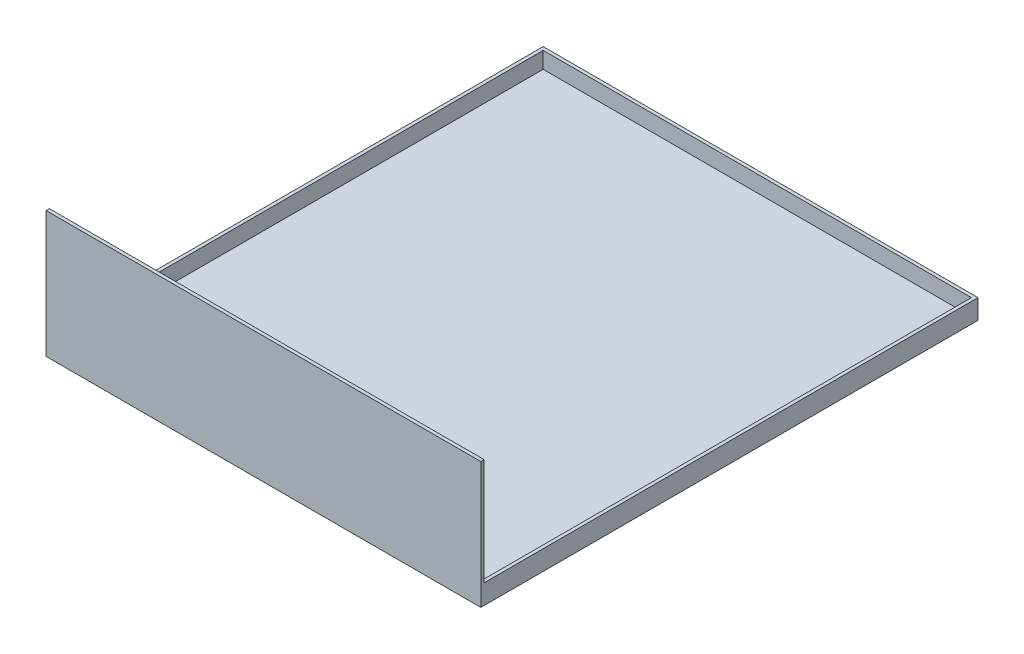
ISO-10303-21;
HEADER;
FILE_DESCRIPTION(('STEP AP214'),'2;1');
FILE_NAME('part.step','',(''),(''),'','','');
FILE_SCHEMA(('AUTOMOTIVE_DESIGN { 1 0 10303 214 1 1 1 1 }'));
ENDSEC;
DATA;
#1=APPLICATION_CONTEXT('core data for automotive mechanical design processes');
#2=APPLICATION_PROTOCOL_DEFINITION('international standard','automotive_design',2000,#1);
#3=PRODUCT_CONTEXT('',#1,'mechanical');
#4=PRODUCT('Part','Part','',(#3));
#5=PRODUCT_RELATED_PRODUCT_CATEGORY('part','',(#4));
#6=PRODUCT_DEFINITION_FORMATION('','',#4);
#7=PRODUCT_DEFINITION_CONTEXT('part definition',#1,'design');
#8=PRODUCT_DEFINITION('design','',#6,#7);
#9=PRODUCT_DEFINITION_SHAPE('','',#8);
#10=(LENGTH_UNIT() NAMED_UNIT(*) SI_UNIT(.MILLI.,.METRE.));
#11=(NAMED_UNIT(*) PLANE_ANGLE_UNIT() SI_UNIT($,.RADIAN.));
#12=(NAMED_UNIT(*) SI_UNIT($,.STERADIAN.) SOLID_ANGLE_UNIT());
#13=UNCERTAINTY_MEASURE_WITH_UNIT(LENGTH_MEASURE(1.E-05),#10,'distance_accuracy_value','');
#14=(GEOMETRIC_REPRESENTATION_CONTEXT(3) GLOBAL_UNCERTAINTY_ASSIGNED_CONTEXT((#13)) GLOBAL_UNIT_ASSIGNED_CONTEXT((#10,
#11,#12)) REPRESENTATION_CONTEXT('',''));
#15=CARTESIAN_POINT('',(0.,0.,0.));
#16=DIRECTION('',(0.,0.,1.));
#17=DIRECTION('',(1.,0.,0.));
#18=AXIS2_PLACEMENT_3D('',#15,#16,#17);
#19=CARTESIAN_POINT('',(0.,0.,0.));
#20=DIRECTION('',(0.,0.,1.));
#21=DIRECTION('',(1.,0.,0.));
#22=AXIS2_PLACEMENT_3D('',#19,#20,#21);
#23=PLANE('',#22);
#24=DIRECTION('',(-1.,0.,0.));
#25=VECTOR('',#24,1.);
#26=CARTESIAN_POINT('',(-132.5,-19.,0.));
#27=LINE('',#26,#25);
#28=CARTESIAN_POINT('',(132.5,-19.,0.));
#29=VERTEX_POINT('',#28);
#30=CARTESIAN_POINT('',(-132.5,-19.,0.));
#31=VERTEX_POINT('',#30);
#32=EDGE_CURVE('E89',#29,#31,#27,.T.);
#33=ORIENTED_EDGE('',*,*,#32,.F.);
#34=DIRECTION('',(0.,1.,0.));
#35=VECTOR('',#34,1.);
#36=CARTESIAN_POINT('',(132.5,31.,0.));
#37=LINE('',#36,#35);
#38=CARTESIAN_POINT('',(132.5,-31.,0.));
#39=VERTEX_POINT('',#38);
#40=EDGE_CURVE('E84',#39,#29,#37,.T.);
#41=ORIENTED_EDGE('',*,*,#40,.F.);
#42=DIRECTION('',(1.,0.,0.));
#43=VECTOR('',#42,1.);
#44=CARTESIAN_POINT('',(-132.5,-31.,0.));
#45=LINE('',#44,#43);
#46=CARTESIAN_POINT('',(-132.5,-31.,0.));
#47=VERTEX_POINT('',#46);
#48=EDGE_CURVE('E68',#47,#39,#45,.T.);
#49=ORIENTED_EDGE('',*,*,#48,.F.);
#50=DIRECTION('',(0.,-1.,0.));
#51=VECTOR('',#50,1.);
#52=CARTESIAN_POINT('',(-132.5,31.,0.));
#53=LINE('',#52,#51);
#54=EDGE_CURVE('E78',#31,#47,#53,.T.);
#55=ORIENTED_EDGE('',*,*,#54,.F.);
#56=EDGE_LOOP('',(#33,#41,#49,#55));
#57=FACE_BOUND('',#56,.T.);
#58=ADVANCED_FACE('F32',(#57),#23,.F.);
#59=CARTESIAN_POINT('',(130.5,31.,303.));
#60=DIRECTION('',(-1.,0.,0.));
#61=DIRECTION('',(0.,0.,1.));
#62=AXIS2_PLACEMENT_3D('',#59,#60,#61);
#63=PLANE('',#62);
#64=DIRECTION('',(0.,1.,0.));
#65=VECTOR('',#64,1.);
#66=CARTESIAN_POINT('',(130.5,31.,301.));
#67=LINE('',#66,#65);
#68=CARTESIAN_POINT('',(130.5,-29.,301.));
#69=VERTEX_POINT('',#68);
#70=CARTESIAN_POINT('',(130.5,-19.,301.));
#71=VERTEX_POINT('',#70);
#72=EDGE_CURVE('E105',#69,#71,#67,.T.);
#73=ORIENTED_EDGE('',*,*,#72,.T.);
#74=DIRECTION('',(0.,0.,-1.));
#75=VECTOR('',#74,1.);
#76=CARTESIAN_POINT('',(130.5,-19.,303.));
#77=LINE('',#76,#75);
#78=CARTESIAN_POINT('',(130.5,-19.,2.));
#79=VERTEX_POINT('',#78);
#80=EDGE_CURVE('E121',#71,#79,#77,.T.);
#81=ORIENTED_EDGE('',*,*,#80,.T.);
#82=DIRECTION('',(0.,1.,0.));
#83=VECTOR('',#82,1.);
#84=CARTESIAN_POINT('',(130.5,31.,2.));
#85=LINE('',#84,#83);
#86=CARTESIAN_POINT('',(130.5,-29.,2.));
#87=VERTEX_POINT('',#86);
#88=EDGE_CURVE('E109',#87,#79,#85,.T.);
#89=ORIENTED_EDGE('',*,*,#88,.F.);
#90=DIRECTION('',(0.,0.,-1.));
#91=VECTOR('',#90,1.);
#92=CARTESIAN_POINT('',(130.5,-29.,303.));
#93=LINE('',#92,#91);
#94=EDGE_CURVE('E94',#69,#87,#93,.T.);
#95=ORIENTED_EDGE('',*,*,#94,.F.);
#96=EDGE_LOOP('',(#73,#81,#89,#95));
#97=FACE_BOUND('',#96,.T.);
#98=ADVANCED_FACE('F208',(#97),#63,.T.);
#99=CARTESIAN_POINT('',(-130.5,31.,303.));
#100=DIRECTION('',(1.,0.,0.));
#101=DIRECTION('',(0.,0.,-1.));
#102=AXIS2_PLACEMENT_3D('',#99,#100,#101);
#103=PLANE('',#102);
#104=DIRECTION('',(0.,-1.,0.));
#105=VECTOR('',#104,1.);
#106=CARTESIAN_POINT('',(-130.5,31.,2.));
#107=LINE('',#106,#105);
#108=CARTESIAN_POINT('',(-130.5,-19.,2.));
#109=VERTEX_POINT('',#108);
#110=CARTESIAN_POINT('',(-130.5,-29.,2.));
#111=VERTEX_POINT('',#110);
#112=EDGE_CURVE('E106',#109,#111,#107,.T.);
#113=ORIENTED_EDGE('',*,*,#112,.F.);
#114=DIRECTION('',(0.,0.,1.));
#115=VECTOR('',#114,1.);
#116=CARTESIAN_POINT('',(-130.5,-19.,303.));
#117=LINE('',#116,#115);
#118=CARTESIAN_POINT('',(-130.5,-19.,301.));
#119=VERTEX_POINT('',#118);
#120=EDGE_CURVE('E47',#109,#119,#117,.T.);
#121=ORIENTED_EDGE('',*,*,#120,.T.);
#122=DIRECTION('',(0.,-1.,0.));
#123=VECTOR('',#122,1.);
#124=CARTESIAN_POINT('',(-130.5,31.,301.));
#125=LINE('',#124,#123);
#126=CARTESIAN_POINT('',(-130.5,-29.,301.));
#127=VERTEX_POINT('',#126);
#128=EDGE_CURVE('E101',#119,#127,#125,.T.);
#129=ORIENTED_EDGE('',*,*,#128,.T.);
#130=DIRECTION('',(0.,0.,-1.));
#131=VECTOR('',#130,1.);
#132=CARTESIAN_POINT('',(-130.5,-29.,303.));
#133=LINE('',#132,#131);
#134=EDGE_CURVE('E90',#127,#111,#133,.T.);
#135=ORIENTED_EDGE('',*,*,#134,.T.);
#136=EDGE_LOOP('',(#113,#121,#129,#135));
#137=FACE_BOUND('',#136,.T.);
#138=ADVANCED_FACE('F197',(#137),#103,.T.);
#139=CARTESIAN_POINT('',(0.,0.,2.));
#140=DIRECTION('',(0.,0.,1.));
#141=DIRECTION('',(1.,0.,0.));
#142=AXIS2_PLACEMENT_3D('',#139,#140,#141);
#143=PLANE('',#142);
#144=ORIENTED_EDGE('',*,*,#88,.T.);
#145=DIRECTION('',(-1.,0.,0.));
#146=VECTOR('',#145,1.);
#147=CARTESIAN_POINT('',(0.,-19.,2.));
#148=LINE('',#147,#146);
#149=EDGE_CURVE('E11',#79,#109,#148,.T.);
#150=ORIENTED_EDGE('',*,*,#149,.T.);
#151=ORIENTED_EDGE('',*,*,#112,.T.);
#152=DIRECTION('',(1.,0.,0.));
#153=VECTOR('',#152,1.);
#154=CARTESIAN_POINT('',(-132.5,-29.,2.));
#155=LINE('',#154,#153);
#156=EDGE_CURVE('E108',#111,#87,#155,.T.);
#157=ORIENTED_EDGE('',*,*,#156,.T.);
#158=EDGE_LOOP('',(#144,#150,#151,#157));
#159=FACE_BOUND('',#158,.T.);
#160=ADVANCED_FACE('F211',(#159),#143,.T.);
#161=CARTESIAN_POINT('',(132.5,31.,303.));
#162=DIRECTION('',(-1.,0.,0.));
#163=DIRECTION('',(0.,0.,1.));
#164=AXIS2_PLACEMENT_3D('',#161,#162,#163);
#165=PLANE('',#164);
#166=DIRECTION('',(0.,0.,-1.));
#167=VECTOR('',#166,1.);
#168=CARTESIAN_POINT('',(132.5,-19.,0.));
#169=LINE('',#168,#167);
#170=CARTESIAN_POINT('',(132.5,-19.,301.));
#171=VERTEX_POINT('',#170);
#172=EDGE_CURVE('E132',#171,#29,#169,.T.);
#173=ORIENTED_EDGE('',*,*,#172,.F.);
#174=DIRECTION('',(0.,1.,0.));
#175=VECTOR('',#174,1.);
#176=CARTESIAN_POINT('',(132.5,-19.,301.));
#177=LINE('',#176,#175);
#178=CARTESIAN_POINT('',(132.5,46.,301.));
#179=VERTEX_POINT('',#178);
#180=EDGE_CURVE('E125',#171,#179,#177,.T.);
#181=ORIENTED_EDGE('',*,*,#180,.T.);
#182=DIRECTION('',(0.,0.,-1.));
#183=VECTOR('',#182,1.);
#184=CARTESIAN_POINT('',(132.5,46.,301.));
#185=LINE('',#184,#183);
#186=CARTESIAN_POINT('',(132.5,46.,303.));
#187=VERTEX_POINT('',#186);
#188=EDGE_CURVE('E144',#187,#179,#185,.T.);
#189=ORIENTED_EDGE('',*,*,#188,.F.);
#190=DIRECTION('',(0.,1.,0.));
#191=VECTOR('',#190,1.);
#192=CARTESIAN_POINT('',(132.5,31.,303.));
#193=LINE('',#192,#191);
#194=CARTESIAN_POINT('',(132.5,-31.,303.));
#195=VERTEX_POINT('',#194);
#196=EDGE_CURVE('E77',#195,#187,#193,.T.);
#197=ORIENTED_EDGE('',*,*,#196,.F.);
#198=DIRECTION('',(0.,0.,-1.));
#199=VECTOR('',#198,1.);
#200=CARTESIAN_POINT('',(132.5,-31.,303.));
#201=LINE('',#200,#199);
#202=EDGE_CURVE('E71',#195,#39,#201,.T.);
#203=ORIENTED_EDGE('',*,*,#202,.T.);
#204=ORIENTED_EDGE('',*,*,#40,.T.);
#205=EDGE_LOOP('',(#173,#181,#189,#197,#203,#204));
#206=FACE_BOUND('',#205,.T.);
#207=ADVANCED_FACE('F34',(#206),#165,.F.);
#208=CARTESIAN_POINT('',(-132.5,31.,303.));
#209=DIRECTION('',(1.,0.,0.));
#210=DIRECTION('',(0.,0.,-1.));
#211=AXIS2_PLACEMENT_3D('',#208,#209,#210);
#212=PLANE('',#211);
#213=DIRECTION('',(0.,-1.,0.));
#214=VECTOR('',#213,1.);
#215=CARTESIAN_POINT('',(-132.5,31.,303.));
#216=LINE('',#215,#214);
#217=CARTESIAN_POINT('',(-132.5,46.,303.));
#218=VERTEX_POINT('',#217);
#219=CARTESIAN_POINT('',(-132.5,-31.,303.));
#220=VERTEX_POINT('',#219);
#221=EDGE_CURVE('E98',#218,#220,#216,.T.);
#222=ORIENTED_EDGE('',*,*,#221,.F.);
#223=DIRECTION('',(0.,0.,1.));
#224=VECTOR('',#223,1.);
#225=CARTESIAN_POINT('',(-132.5,46.,301.));
#226=LINE('',#225,#224);
#227=CARTESIAN_POINT('',(-132.5,46.,301.));
#228=VERTEX_POINT('',#227);
#229=EDGE_CURVE('E150',#228,#218,#226,.T.);
#230=ORIENTED_EDGE('',*,*,#229,.F.);
#231=DIRECTION('',(0.,1.,0.));
#232=VECTOR('',#231,1.);
#233=CARTESIAN_POINT('',(-132.5,-19.,301.));
#234=LINE('',#233,#232);
#235=CARTESIAN_POINT('',(-132.5,-19.,301.));
#236=VERTEX_POINT('',#235);
#237=EDGE_CURVE('E126',#236,#228,#234,.T.);
#238=ORIENTED_EDGE('',*,*,#237,.F.);
#239=DIRECTION('',(0.,0.,1.));
#240=VECTOR('',#239,1.);
#241=CARTESIAN_POINT('',(-132.5,-19.,0.));
#242=LINE('',#241,#240);
#243=EDGE_CURVE('E138',#31,#236,#242,.T.);
#244=ORIENTED_EDGE('',*,*,#243,.F.);
#245=ORIENTED_EDGE('',*,*,#54,.T.);
#246=DIRECTION('',(0.,0.,-1.));
#247=VECTOR('',#246,1.);
#248=CARTESIAN_POINT('',(-132.5,-31.,303.));
#249=LINE('',#248,#247);
#250=EDGE_CURVE('E40',#220,#47,#249,.T.);
#251=ORIENTED_EDGE('',*,*,#250,.F.);
#252=EDGE_LOOP('',(#222,#230,#238,#244,#245,#251));
#253=FACE_BOUND('',#252,.T.);
#254=ADVANCED_FACE('F164',(#253),#212,.F.);
#255=CARTESIAN_POINT('',(-132.5,-31.,303.));
#256=DIRECTION('',(0.,1.,0.));
#257=DIRECTION('',(0.,0.,1.));
#258=AXIS2_PLACEMENT_3D('',#255,#256,#257);
#259=PLANE('',#258);
#260=ORIENTED_EDGE('',*,*,#48,.T.);
#261=ORIENTED_EDGE('',*,*,#202,.F.);
#262=DIRECTION('',(1.,0.,0.));
#263=VECTOR('',#262,1.);
#264=CARTESIAN_POINT('',(-132.5,-31.,303.));
#265=LINE('',#264,#263);
#266=EDGE_CURVE('E55',#220,#195,#265,.T.);
#267=ORIENTED_EDGE('',*,*,#266,.F.);
#268=ORIENTED_EDGE('',*,*,#250,.T.);
#269=EDGE_LOOP('',(#260,#261,#267,#268));
#270=FACE_BOUND('',#269,.T.);
#271=ADVANCED_FACE('F70',(#270),#259,.F.);
#272=CARTESIAN_POINT('',(0.,0.,303.));
#273=DIRECTION('',(0.,0.,1.));
#274=DIRECTION('',(1.,0.,0.));
#275=AXIS2_PLACEMENT_3D('',#272,#273,#274);
#276=PLANE('',#275);
#277=ORIENTED_EDGE('',*,*,#196,.T.);
#278=DIRECTION('',(1.,0.,0.));
#279=VECTOR('',#278,1.);
#280=CARTESIAN_POINT('',(-132.5,46.,303.));
#281=LINE('',#280,#279);
#282=EDGE_CURVE('E147',#218,#187,#281,.T.);
#283=ORIENTED_EDGE('',*,*,#282,.F.);
#284=ORIENTED_EDGE('',*,*,#221,.T.);
#285=ORIENTED_EDGE('',*,*,#266,.T.);
#286=EDGE_LOOP('',(#277,#283,#284,#285));
#287=FACE_BOUND('',#286,.T.);
#288=ADVANCED_FACE('F213',(#287),#276,.T.);
#289=CARTESIAN_POINT('',(-132.5,-29.,303.));
#290=DIRECTION('',(0.,1.,0.));
#291=DIRECTION('',(0.,0.,1.));
#292=AXIS2_PLACEMENT_3D('',#289,#290,#291);
#293=PLANE('',#292);
#294=ORIENTED_EDGE('',*,*,#156,.F.);
#295=ORIENTED_EDGE('',*,*,#134,.F.);
#296=DIRECTION('',(1.,0.,0.));
#297=VECTOR('',#296,1.);
#298=CARTESIAN_POINT('',(-132.5,-29.,301.));
#299=LINE('',#298,#297);
#300=EDGE_CURVE('E104',#127,#69,#299,.T.);
#301=ORIENTED_EDGE('',*,*,#300,.T.);
#302=ORIENTED_EDGE('',*,*,#94,.T.);
#303=EDGE_LOOP('',(#294,#295,#301,#302));
#304=FACE_BOUND('',#303,.T.);
#305=ADVANCED_FACE('F201',(#304),#293,.T.);
#306=CARTESIAN_POINT('',(0.,0.,301.));
#307=DIRECTION('',(0.,0.,1.));
#308=DIRECTION('',(1.,0.,0.));
#309=AXIS2_PLACEMENT_3D('',#306,#307,#308);
#310=PLANE('',#309);
#311=ORIENTED_EDGE('',*,*,#237,.T.);
#312=DIRECTION('',(-1.,0.,0.));
#313=VECTOR('',#312,1.);
#314=CARTESIAN_POINT('',(-132.5,46.,301.));
#315=LINE('',#314,#313);
#316=EDGE_CURVE('E141',#179,#228,#315,.T.);
#317=ORIENTED_EDGE('',*,*,#316,.F.);
#318=ORIENTED_EDGE('',*,*,#180,.F.);
#319=DIRECTION('',(1.,0.,0.));
#320=VECTOR('',#319,1.);
#321=CARTESIAN_POINT('',(-132.5,-19.,301.));
#322=LINE('',#321,#320);
#323=EDGE_CURVE('E137',#71,#171,#322,.T.);
#324=ORIENTED_EDGE('',*,*,#323,.F.);
#325=ORIENTED_EDGE('',*,*,#72,.F.);
#326=ORIENTED_EDGE('',*,*,#300,.F.);
#327=ORIENTED_EDGE('',*,*,#128,.F.);
#328=EDGE_CURVE('E135',#236,#119,#322,.T.);
#329=ORIENTED_EDGE('',*,*,#328,.F.);
#330=EDGE_LOOP('',(#311,#317,#318,#324,#325,#326,#327,#329));
#331=FACE_BOUND('',#330,.T.);
#332=ADVANCED_FACE('F204',(#331),#310,.F.);
#333=CARTESIAN_POINT('',(0.,-19.,0.));
#334=DIRECTION('',(0.,1.,0.));
#335=DIRECTION('',(0.,0.,1.));
#336=AXIS2_PLACEMENT_3D('',#333,#334,#335);
#337=PLANE('',#336);
#338=ORIENTED_EDGE('',*,*,#323,.T.);
#339=ORIENTED_EDGE('',*,*,#172,.T.);
#340=ORIENTED_EDGE('',*,*,#32,.T.);
#341=ORIENTED_EDGE('',*,*,#243,.T.);
#342=ORIENTED_EDGE('',*,*,#328,.T.);
#343=ORIENTED_EDGE('',*,*,#120,.F.);
#344=ORIENTED_EDGE('',*,*,#149,.F.);
#345=ORIENTED_EDGE('',*,*,#80,.F.);
#346=EDGE_LOOP('',(#338,#339,#340,#341,#342,#343,#344,#345));
#347=FACE_BOUND('',#346,.T.);
#348=ADVANCED_FACE('F212',(#347),#337,.T.);
#349=CARTESIAN_POINT('',(0.,46.,0.));
#350=DIRECTION('',(0.,1.,0.));
#351=DIRECTION('',(0.,0.,1.));
#352=AXIS2_PLACEMENT_3D('',#349,#350,#351);
#353=PLANE('',#352);
#354=ORIENTED_EDGE('',*,*,#229,.T.);
#355=ORIENTED_EDGE('',*,*,#282,.T.);
#356=ORIENTED_EDGE('',*,*,#188,.T.);
#357=ORIENTED_EDGE('',*,*,#316,.T.);
#358=EDGE_LOOP('',(#354,#355,#356,#357));
#359=FACE_BOUND('',#358,.T.);
#360=ADVANCED_FACE('F155',(#359),#353,.T.);
#361=CLOSED_SHELL('',(#58,#98,#138,#160,#207,#254,#271,#288,#305,#332,#348,#360));
#362=MANIFOLD_SOLID_BREP('B2',#361);
#363=ADVANCED_BREP_SHAPE_REPRESENTATION('',(#18,#362),#14);
#364=SHAPE_DEFINITION_REPRESENTATION(#9,#363);
ENDSEC;
END-ISO-10303-21;
